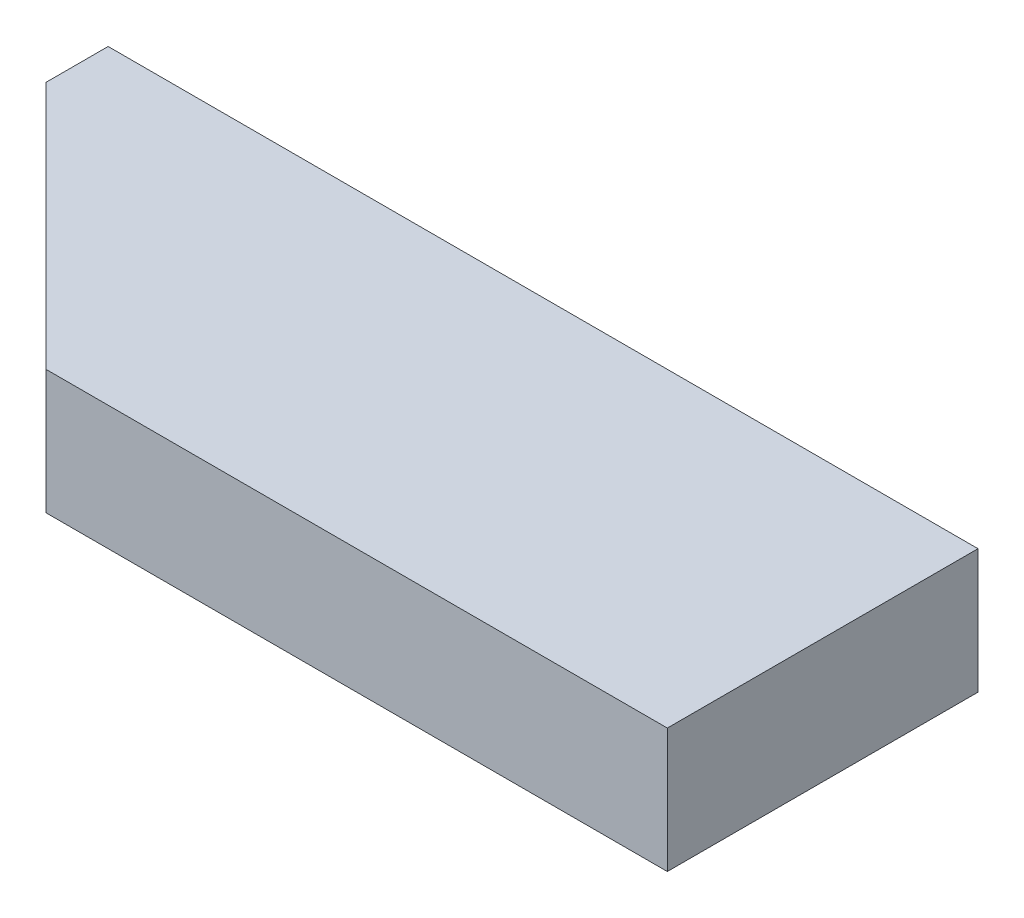
ISO-10303-21;
HEADER;
FILE_DESCRIPTION(('STEP AP214'),'2;1');
FILE_NAME('part.step','',(''),(''),'','','');
FILE_SCHEMA(('AUTOMOTIVE_DESIGN { 1 0 10303 214 1 1 1 1 }'));
ENDSEC;
DATA;
#1=APPLICATION_CONTEXT('core data for automotive mechanical design processes');
#2=APPLICATION_PROTOCOL_DEFINITION('international standard','automotive_design',2000,#1);
#3=PRODUCT_CONTEXT('',#1,'mechanical');
#4=PRODUCT('Part','Part','',(#3));
#5=PRODUCT_RELATED_PRODUCT_CATEGORY('part','',(#4));
#6=PRODUCT_DEFINITION_FORMATION('','',#4);
#7=PRODUCT_DEFINITION_CONTEXT('part definition',#1,'design');
#8=PRODUCT_DEFINITION('design','',#6,#7);
#9=PRODUCT_DEFINITION_SHAPE('','',#8);
#10=(LENGTH_UNIT() NAMED_UNIT(*) SI_UNIT(.MILLI.,.METRE.));
#11=(NAMED_UNIT(*) PLANE_ANGLE_UNIT() SI_UNIT($,.RADIAN.));
#12=(NAMED_UNIT(*) SI_UNIT($,.STERADIAN.) SOLID_ANGLE_UNIT());
#13=UNCERTAINTY_MEASURE_WITH_UNIT(LENGTH_MEASURE(1.E-05),#10,'distance_accuracy_value','');
#14=(GEOMETRIC_REPRESENTATION_CONTEXT(3) GLOBAL_UNCERTAINTY_ASSIGNED_CONTEXT((#13)) GLOBAL_UNIT_ASSIGNED_CONTEXT((#10,
#11,#12)) REPRESENTATION_CONTEXT('',''));
#15=CARTESIAN_POINT('',(0.,0.,0.));
#16=DIRECTION('',(0.,0.,1.));
#17=DIRECTION('',(1.,0.,0.));
#18=AXIS2_PLACEMENT_3D('',#15,#16,#17);
#19=CARTESIAN_POINT('',(35.,10.,-12.5));
#20=DIRECTION('',(-1.,0.,0.));
#21=DIRECTION('',(0.,0.,1.));
#22=AXIS2_PLACEMENT_3D('',#19,#20,#21);
#23=PLANE('',#22);
#24=DIRECTION('',(0.,0.,-1.));
#25=VECTOR('',#24,1.);
#26=CARTESIAN_POINT('',(35.,0.,-12.5));
#27=LINE('',#26,#25);
#28=CARTESIAN_POINT('',(35.,0.,12.5));
#29=VERTEX_POINT('',#28);
#30=CARTESIAN_POINT('',(35.,0.,-12.5));
#31=VERTEX_POINT('',#30);
#32=EDGE_CURVE('E111',#29,#31,#27,.T.);
#33=ORIENTED_EDGE('',*,*,#32,.T.);
#34=DIRECTION('',(0.,-1.,0.));
#35=VECTOR('',#34,1.);
#36=CARTESIAN_POINT('',(35.,10.,-12.5));
#37=LINE('',#36,#35);
#38=CARTESIAN_POINT('',(35.,10.,-12.5));
#39=VERTEX_POINT('',#38);
#40=EDGE_CURVE('E93',#39,#31,#37,.T.);
#41=ORIENTED_EDGE('',*,*,#40,.F.);
#42=DIRECTION('',(0.,0.,-1.));
#43=VECTOR('',#42,1.);
#44=CARTESIAN_POINT('',(35.,10.,-12.5));
#45=LINE('',#44,#43);
#46=CARTESIAN_POINT('',(35.,10.,12.5));
#47=VERTEX_POINT('',#46);
#48=EDGE_CURVE('E99',#47,#39,#45,.T.);
#49=ORIENTED_EDGE('',*,*,#48,.F.);
#50=DIRECTION('',(0.,-1.,0.));
#51=VECTOR('',#50,1.);
#52=CARTESIAN_POINT('',(35.,10.,12.5));
#53=LINE('',#52,#51);
#54=EDGE_CURVE('E116',#47,#29,#53,.T.);
#55=ORIENTED_EDGE('',*,*,#54,.T.);
#56=EDGE_LOOP('',(#33,#41,#49,#55));
#57=FACE_BOUND('',#56,.T.);
#58=ADVANCED_FACE('F41',(#57),#23,.F.);
#59=CARTESIAN_POINT('',(-35.,10.,-12.5));
#60=DIRECTION('',(0.,0.,1.));
#61=DIRECTION('',(1.,0.,0.));
#62=AXIS2_PLACEMENT_3D('',#59,#60,#61);
#63=PLANE('',#62);
#64=DIRECTION('',(-1.,0.,0.));
#65=VECTOR('',#64,1.);
#66=CARTESIAN_POINT('',(-35.,0.,-12.5));
#67=LINE('',#66,#65);
#68=CARTESIAN_POINT('',(-35.,0.,-12.5));
#69=VERTEX_POINT('',#68);
#70=EDGE_CURVE('E124',#31,#69,#67,.T.);
#71=ORIENTED_EDGE('',*,*,#70,.T.);
#72=DIRECTION('',(0.,-1.,0.));
#73=VECTOR('',#72,1.);
#74=CARTESIAN_POINT('',(-35.,10.,-12.5));
#75=LINE('',#74,#73);
#76=CARTESIAN_POINT('',(-35.,10.,-12.5));
#77=VERTEX_POINT('',#76);
#78=EDGE_CURVE('E96',#77,#69,#75,.T.);
#79=ORIENTED_EDGE('',*,*,#78,.F.);
#80=DIRECTION('',(-1.,0.,0.));
#81=VECTOR('',#80,1.);
#82=CARTESIAN_POINT('',(-35.,10.,-12.5));
#83=LINE('',#82,#81);
#84=EDGE_CURVE('E89',#39,#77,#83,.T.);
#85=ORIENTED_EDGE('',*,*,#84,.F.);
#86=ORIENTED_EDGE('',*,*,#40,.T.);
#87=EDGE_LOOP('',(#71,#79,#85,#86));
#88=FACE_BOUND('',#87,.T.);
#89=ADVANCED_FACE('F91',(#88),#63,.F.);
#90=CARTESIAN_POINT('',(-35.,10.,-12.5));
#91=DIRECTION('',(1.,0.,0.));
#92=DIRECTION('',(0.,0.,-1.));
#93=AXIS2_PLACEMENT_3D('',#90,#91,#92);
#94=PLANE('',#93);
#95=DIRECTION('',(0.,0.,1.));
#96=VECTOR('',#95,1.);
#97=CARTESIAN_POINT('',(-35.,0.,-12.5));
#98=LINE('',#97,#96);
#99=CARTESIAN_POINT('',(-35.,0.,-7.50000000000008));
#100=VERTEX_POINT('',#99);
#101=EDGE_CURVE('E122',#69,#100,#98,.T.);
#102=ORIENTED_EDGE('',*,*,#101,.T.);
#103=DIRECTION('',(0.,1.,0.));
#104=VECTOR('',#103,1.);
#105=CARTESIAN_POINT('',(-35.,10.,-7.50000000000008));
#106=LINE('',#105,#104);
#107=CARTESIAN_POINT('',(-35.,10.,-7.50000000000008));
#108=VERTEX_POINT('',#107);
#109=EDGE_CURVE('E50',#100,#108,#106,.T.);
#110=ORIENTED_EDGE('',*,*,#109,.T.);
#111=DIRECTION('',(0.,0.,1.));
#112=VECTOR('',#111,1.);
#113=CARTESIAN_POINT('',(-35.,10.,-12.5));
#114=LINE('',#113,#112);
#115=EDGE_CURVE('E98',#77,#108,#114,.T.);
#116=ORIENTED_EDGE('',*,*,#115,.F.);
#117=ORIENTED_EDGE('',*,*,#78,.T.);
#118=EDGE_LOOP('',(#102,#110,#116,#117));
#119=FACE_BOUND('',#118,.T.);
#120=ADVANCED_FACE('F134',(#119),#94,.F.);
#121=CARTESIAN_POINT('',(-35.,10.,12.5));
#122=DIRECTION('',(0.,0.,-1.));
#123=DIRECTION('',(-1.,0.,0.));
#124=AXIS2_PLACEMENT_3D('',#121,#122,#123);
#125=PLANE('',#124);
#126=DIRECTION('',(1.,0.,0.));
#127=VECTOR('',#126,1.);
#128=CARTESIAN_POINT('',(-35.,10.,12.5));
#129=LINE('',#128,#127);
#130=CARTESIAN_POINT('',(-15.,10.,12.5));
#131=VERTEX_POINT('',#130);
#132=EDGE_CURVE('E104',#131,#47,#129,.T.);
#133=ORIENTED_EDGE('',*,*,#132,.F.);
#134=DIRECTION('',(0.,-1.,0.));
#135=VECTOR('',#134,1.);
#136=CARTESIAN_POINT('',(-15.,10.,12.5));
#137=LINE('',#136,#135);
#138=CARTESIAN_POINT('',(-15.,0.,12.5));
#139=VERTEX_POINT('',#138);
#140=EDGE_CURVE('E112',#131,#139,#137,.T.);
#141=ORIENTED_EDGE('',*,*,#140,.T.);
#142=DIRECTION('',(1.,0.,0.));
#143=VECTOR('',#142,1.);
#144=CARTESIAN_POINT('',(-35.,0.,12.5));
#145=LINE('',#144,#143);
#146=EDGE_CURVE('E108',#139,#29,#145,.T.);
#147=ORIENTED_EDGE('',*,*,#146,.T.);
#148=ORIENTED_EDGE('',*,*,#54,.F.);
#149=EDGE_LOOP('',(#133,#141,#147,#148));
#150=FACE_BOUND('',#149,.T.);
#151=ADVANCED_FACE('F132',(#150),#125,.F.);
#152=CARTESIAN_POINT('',(0.,10.,0.));
#153=DIRECTION('',(0.,1.,0.));
#154=DIRECTION('',(0.,0.,1.));
#155=AXIS2_PLACEMENT_3D('',#152,#153,#154);
#156=PLANE('',#155);
#157=ORIENTED_EDGE('',*,*,#115,.T.);
#158=DIRECTION('',(-0.707106781186547,0.,-0.707106781186549));
#159=VECTOR('',#158,1.);
#160=CARTESIAN_POINT('',(-13.75,10.,13.75));
#161=LINE('',#160,#159);
#162=EDGE_CURVE('E11',#108,#131,#161,.F.);
#163=ORIENTED_EDGE('',*,*,#162,.T.);
#164=ORIENTED_EDGE('',*,*,#132,.T.);
#165=ORIENTED_EDGE('',*,*,#48,.T.);
#166=ORIENTED_EDGE('',*,*,#84,.T.);
#167=EDGE_LOOP('',(#157,#163,#164,#165,#166));
#168=FACE_BOUND('',#167,.T.);
#169=ADVANCED_FACE('F102',(#168),#156,.T.);
#170=CARTESIAN_POINT('',(0.,0.,0.));
#171=DIRECTION('',(0.,1.,0.));
#172=DIRECTION('',(0.,0.,1.));
#173=AXIS2_PLACEMENT_3D('',#170,#171,#172);
#174=PLANE('',#173);
#175=ORIENTED_EDGE('',*,*,#146,.F.);
#176=DIRECTION('',(0.707106781186547,0.,0.707106781186549));
#177=VECTOR('',#176,1.);
#178=CARTESIAN_POINT('',(-15.,0.,12.5));
#179=LINE('',#178,#177);
#180=EDGE_CURVE('E64',#139,#100,#179,.F.);
#181=ORIENTED_EDGE('',*,*,#180,.T.);
#182=ORIENTED_EDGE('',*,*,#101,.F.);
#183=ORIENTED_EDGE('',*,*,#70,.F.);
#184=ORIENTED_EDGE('',*,*,#32,.F.);
#185=EDGE_LOOP('',(#175,#181,#182,#183,#184));
#186=FACE_BOUND('',#185,.T.);
#187=ADVANCED_FACE('F133',(#186),#174,.F.);
#188=CARTESIAN_POINT('',(-15.,10.,12.5));
#189=DIRECTION('',(0.707106781186549,0.,-0.707106781186547));
#190=DIRECTION('',(0.,-1.,0.));
#191=AXIS2_PLACEMENT_3D('',#188,#189,#190);
#192=PLANE('',#191);
#193=ORIENTED_EDGE('',*,*,#162,.F.);
#194=ORIENTED_EDGE('',*,*,#109,.F.);
#195=ORIENTED_EDGE('',*,*,#180,.F.);
#196=ORIENTED_EDGE('',*,*,#140,.F.);
#197=EDGE_LOOP('',(#193,#194,#195,#196));
#198=FACE_BOUND('',#197,.T.);
#199=ADVANCED_FACE('F44',(#198),#192,.F.);
#200=CLOSED_SHELL('',(#58,#89,#120,#151,#169,#187,#199));
#201=MANIFOLD_SOLID_BREP('B2',#200);
#202=ADVANCED_BREP_SHAPE_REPRESENTATION('',(#18,#201),#14);
#203=SHAPE_DEFINITION_REPRESENTATION(#9,#202);
ENDSEC;
END-ISO-10303-21;
